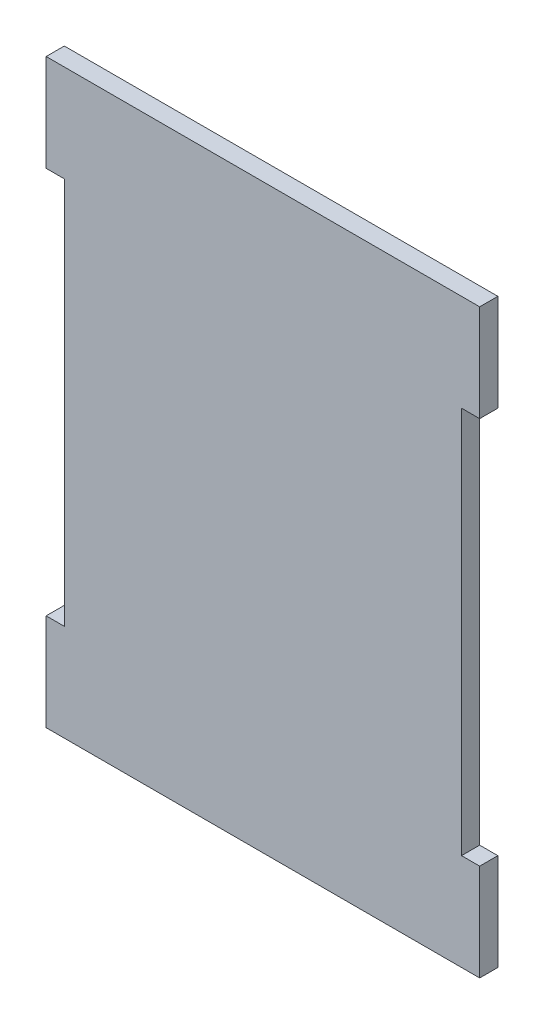
ISO-10303-21;
HEADER;
FILE_DESCRIPTION(('STEP AP214'),'2;1');
FILE_NAME('part.step','',(''),(''),'','','');
FILE_SCHEMA(('AUTOMOTIVE_DESIGN { 1 0 10303 214 1 1 1 1 }'));
ENDSEC;
DATA;
#1=APPLICATION_CONTEXT('core data for automotive mechanical design processes');
#2=APPLICATION_PROTOCOL_DEFINITION('international standard','automotive_design',2000,#1);
#3=PRODUCT_CONTEXT('',#1,'mechanical');
#4=PRODUCT('Part','Part','',(#3));
#5=PRODUCT_RELATED_PRODUCT_CATEGORY('part','',(#4));
#6=PRODUCT_DEFINITION_FORMATION('','',#4);
#7=PRODUCT_DEFINITION_CONTEXT('part definition',#1,'design');
#8=PRODUCT_DEFINITION('design','',#6,#7);
#9=PRODUCT_DEFINITION_SHAPE('','',#8);
#10=(LENGTH_UNIT() NAMED_UNIT(*) SI_UNIT(.MILLI.,.METRE.));
#11=(NAMED_UNIT(*) PLANE_ANGLE_UNIT() SI_UNIT($,.RADIAN.));
#12=(NAMED_UNIT(*) SI_UNIT($,.STERADIAN.) SOLID_ANGLE_UNIT());
#13=UNCERTAINTY_MEASURE_WITH_UNIT(LENGTH_MEASURE(1.E-05),#10,'distance_accuracy_value','');
#14=(GEOMETRIC_REPRESENTATION_CONTEXT(3) GLOBAL_UNCERTAINTY_ASSIGNED_CONTEXT((#13)) GLOBAL_UNIT_ASSIGNED_CONTEXT((#10,
#11,#12)) REPRESENTATION_CONTEXT('',''));
#15=CARTESIAN_POINT('',(0.,0.,0.));
#16=DIRECTION('',(0.,0.,1.));
#17=DIRECTION('',(1.,0.,0.));
#18=AXIS2_PLACEMENT_3D('',#15,#16,#17);
#19=CARTESIAN_POINT('',(0.,108.395374669268,4.7625));
#20=DIRECTION('',(1.,0.,0.));
#21=DIRECTION('',(0.,1.,0.));
#22=AXIS2_PLACEMENT_3D('',#19,#20,#21);
#23=PLANE('',#22);
#24=DIRECTION('',(0.,-1.,0.));
#25=VECTOR('',#24,1.);
#26=CARTESIAN_POINT('',(0.,108.395374669268,0.));
#27=LINE('',#26,#25);
#28=CARTESIAN_POINT('',(0.,108.395374669268,0.));
#29=VERTEX_POINT('',#28);
#30=CARTESIAN_POINT('',(0.,82.9953746692675,0.));
#31=VERTEX_POINT('',#30);
#32=EDGE_CURVE('E158',#29,#31,#27,.T.);
#33=ORIENTED_EDGE('',*,*,#32,.T.);
#34=DIRECTION('',(0.,0.,-1.));
#35=VECTOR('',#34,1.);
#36=CARTESIAN_POINT('',(0.,82.9953746692675,4.7625));
#37=LINE('',#36,#35);
#38=CARTESIAN_POINT('',(0.,82.9953746692675,4.7625));
#39=VERTEX_POINT('',#38);
#40=EDGE_CURVE('E41',#39,#31,#37,.T.);
#41=ORIENTED_EDGE('',*,*,#40,.F.);
#42=DIRECTION('',(0.,-1.,0.));
#43=VECTOR('',#42,1.);
#44=CARTESIAN_POINT('',(0.,108.395374669268,4.7625));
#45=LINE('',#44,#43);
#46=CARTESIAN_POINT('',(0.,108.395374669268,4.7625));
#47=VERTEX_POINT('',#46);
#48=EDGE_CURVE('E106',#47,#39,#45,.T.);
#49=ORIENTED_EDGE('',*,*,#48,.F.);
#50=DIRECTION('',(0.,0.,-1.));
#51=VECTOR('',#50,1.);
#52=CARTESIAN_POINT('',(0.,108.395374669268,4.7625));
#53=LINE('',#52,#51);
#54=EDGE_CURVE('E11',#47,#29,#53,.T.);
#55=ORIENTED_EDGE('',*,*,#54,.T.);
#56=EDGE_LOOP('',(#33,#41,#49,#55));
#57=FACE_BOUND('',#56,.T.);
#58=ADVANCED_FACE('F33',(#57),#23,.F.);
#59=CARTESIAN_POINT('',(4.7625,82.9953746692675,4.7625));
#60=DIRECTION('',(0.,1.,0.));
#61=DIRECTION('',(0.,0.,1.));
#62=AXIS2_PLACEMENT_3D('',#59,#60,#61);
#63=PLANE('',#62);
#64=DIRECTION('',(1.,0.,0.));
#65=VECTOR('',#64,1.);
#66=CARTESIAN_POINT('',(4.7625,82.9953746692675,0.));
#67=LINE('',#66,#65);
#68=CARTESIAN_POINT('',(4.7625,82.9953746692675,0.));
#69=VERTEX_POINT('',#68);
#70=EDGE_CURVE('E160',#31,#69,#67,.T.);
#71=ORIENTED_EDGE('',*,*,#70,.T.);
#72=DIRECTION('',(0.,0.,-1.));
#73=VECTOR('',#72,1.);
#74=CARTESIAN_POINT('',(4.7625,82.9953746692675,4.7625));
#75=LINE('',#74,#73);
#76=CARTESIAN_POINT('',(4.7625,82.9953746692675,4.7625));
#77=VERTEX_POINT('',#76);
#78=EDGE_CURVE('E198',#77,#69,#75,.T.);
#79=ORIENTED_EDGE('',*,*,#78,.F.);
#80=DIRECTION('',(1.,0.,0.));
#81=VECTOR('',#80,1.);
#82=CARTESIAN_POINT('',(4.7625,82.9953746692675,4.7625));
#83=LINE('',#82,#81);
#84=EDGE_CURVE('E206',#39,#77,#83,.T.);
#85=ORIENTED_EDGE('',*,*,#84,.F.);
#86=ORIENTED_EDGE('',*,*,#40,.T.);
#87=EDGE_LOOP('',(#71,#79,#85,#86));
#88=FACE_BOUND('',#87,.T.);
#89=ADVANCED_FACE('F204',(#88),#63,.F.);
#90=CARTESIAN_POINT('',(4.7625,82.9953746692675,4.7625));
#91=DIRECTION('',(1.,0.,0.));
#92=DIRECTION('',(0.,0.,-1.));
#93=AXIS2_PLACEMENT_3D('',#90,#91,#92);
#94=PLANE('',#93);
#95=DIRECTION('',(0.,-1.,0.));
#96=VECTOR('',#95,1.);
#97=CARTESIAN_POINT('',(4.7625,82.9953746692675,0.));
#98=LINE('',#97,#96);
#99=CARTESIAN_POINT('',(4.7625,-18.6046253307324,0.));
#100=VERTEX_POINT('',#99);
#101=EDGE_CURVE('E162',#69,#100,#98,.T.);
#102=ORIENTED_EDGE('',*,*,#101,.T.);
#103=DIRECTION('',(0.,0.,-1.));
#104=VECTOR('',#103,1.);
#105=CARTESIAN_POINT('',(4.7625,-18.6046253307324,4.7625));
#106=LINE('',#105,#104);
#107=CARTESIAN_POINT('',(4.7625,-18.6046253307324,4.7625));
#108=VERTEX_POINT('',#107);
#109=EDGE_CURVE('E195',#108,#100,#106,.T.);
#110=ORIENTED_EDGE('',*,*,#109,.F.);
#111=DIRECTION('',(0.,-1.,0.));
#112=VECTOR('',#111,1.);
#113=CARTESIAN_POINT('',(4.7625,82.9953746692675,4.7625));
#114=LINE('',#113,#112);
#115=EDGE_CURVE('E222',#77,#108,#114,.T.);
#116=ORIENTED_EDGE('',*,*,#115,.F.);
#117=ORIENTED_EDGE('',*,*,#78,.T.);
#118=EDGE_LOOP('',(#102,#110,#116,#117));
#119=FACE_BOUND('',#118,.T.);
#120=ADVANCED_FACE('F213',(#119),#94,.F.);
#121=CARTESIAN_POINT('',(4.7625,-18.6046253307324,4.7625));
#122=DIRECTION('',(0.,-1.,0.));
#123=DIRECTION('',(0.,0.,-1.));
#124=AXIS2_PLACEMENT_3D('',#121,#122,#123);
#125=PLANE('',#124);
#126=DIRECTION('',(-1.,0.,0.));
#127=VECTOR('',#126,1.);
#128=CARTESIAN_POINT('',(4.7625,-18.6046253307324,0.));
#129=LINE('',#128,#127);
#130=CARTESIAN_POINT('',(0.,-18.6046253307324,0.));
#131=VERTEX_POINT('',#130);
#132=EDGE_CURVE('E164',#100,#131,#129,.T.);
#133=ORIENTED_EDGE('',*,*,#132,.T.);
#134=DIRECTION('',(0.,0.,-1.));
#135=VECTOR('',#134,1.);
#136=CARTESIAN_POINT('',(0.,-18.6046253307324,4.7625));
#137=LINE('',#136,#135);
#138=CARTESIAN_POINT('',(0.,-18.6046253307324,4.7625));
#139=VERTEX_POINT('',#138);
#140=EDGE_CURVE('E192',#139,#131,#137,.T.);
#141=ORIENTED_EDGE('',*,*,#140,.F.);
#142=DIRECTION('',(-1.,0.,0.));
#143=VECTOR('',#142,1.);
#144=CARTESIAN_POINT('',(4.7625,-18.6046253307324,4.7625));
#145=LINE('',#144,#143);
#146=EDGE_CURVE('E219',#108,#139,#145,.T.);
#147=ORIENTED_EDGE('',*,*,#146,.F.);
#148=ORIENTED_EDGE('',*,*,#109,.T.);
#149=EDGE_LOOP('',(#133,#141,#147,#148));
#150=FACE_BOUND('',#149,.T.);
#151=ADVANCED_FACE('F217',(#150),#125,.F.);
#152=CARTESIAN_POINT('',(0.,-44.0046253307324,4.7625));
#153=DIRECTION('',(1.,0.,0.));
#154=DIRECTION('',(0.,1.,0.));
#155=AXIS2_PLACEMENT_3D('',#152,#153,#154);
#156=PLANE('',#155);
#157=DIRECTION('',(0.,-1.,0.));
#158=VECTOR('',#157,1.);
#159=CARTESIAN_POINT('',(0.,-44.0046253307324,0.));
#160=LINE('',#159,#158);
#161=CARTESIAN_POINT('',(0.,-44.0046253307324,0.));
#162=VERTEX_POINT('',#161);
#163=EDGE_CURVE('E166',#131,#162,#160,.T.);
#164=ORIENTED_EDGE('',*,*,#163,.T.);
#165=DIRECTION('',(0.,0.,-1.));
#166=VECTOR('',#165,1.);
#167=CARTESIAN_POINT('',(0.,-44.0046253307324,4.7625));
#168=LINE('',#167,#166);
#169=CARTESIAN_POINT('',(0.,-44.0046253307324,4.7625));
#170=VERTEX_POINT('',#169);
#171=EDGE_CURVE('E189',#170,#162,#168,.T.);
#172=ORIENTED_EDGE('',*,*,#171,.F.);
#173=DIRECTION('',(0.,-1.,0.));
#174=VECTOR('',#173,1.);
#175=CARTESIAN_POINT('',(0.,-44.0046253307324,4.7625));
#176=LINE('',#175,#174);
#177=EDGE_CURVE('E221',#139,#170,#176,.T.);
#178=ORIENTED_EDGE('',*,*,#177,.F.);
#179=ORIENTED_EDGE('',*,*,#140,.T.);
#180=EDGE_LOOP('',(#164,#172,#178,#179));
#181=FACE_BOUND('',#180,.T.);
#182=ADVANCED_FACE('F256',(#181),#156,.F.);
#183=CARTESIAN_POINT('',(108.9025,-44.0046253307325,4.7625));
#184=DIRECTION('',(0.,1.,0.));
#185=DIRECTION('',(-1.,0.,0.));
#186=AXIS2_PLACEMENT_3D('',#183,#184,#185);
#187=PLANE('',#186);
#188=DIRECTION('',(1.,0.,0.));
#189=VECTOR('',#188,1.);
#190=CARTESIAN_POINT('',(108.9025,-44.0046253307325,0.));
#191=LINE('',#190,#189);
#192=CARTESIAN_POINT('',(113.665,-44.0046253307323,0.));
#193=VERTEX_POINT('',#192);
#194=EDGE_CURVE('E169',#162,#193,#191,.T.);
#195=ORIENTED_EDGE('',*,*,#194,.T.);
#196=DIRECTION('',(0.,0.,-1.));
#197=VECTOR('',#196,1.);
#198=CARTESIAN_POINT('',(113.665,-44.0046253307323,4.7625));
#199=LINE('',#198,#197);
#200=CARTESIAN_POINT('',(113.665,-44.0046253307323,4.7625));
#201=VERTEX_POINT('',#200);
#202=EDGE_CURVE('E186',#201,#193,#199,.T.);
#203=ORIENTED_EDGE('',*,*,#202,.F.);
#204=DIRECTION('',(1.,0.,0.));
#205=VECTOR('',#204,1.);
#206=CARTESIAN_POINT('',(4.76250000000002,-44.0046253307325,4.7625));
#207=LINE('',#206,#205);
#208=EDGE_CURVE('E224',#170,#201,#207,.T.);
#209=ORIENTED_EDGE('',*,*,#208,.F.);
#210=ORIENTED_EDGE('',*,*,#171,.T.);
#211=EDGE_LOOP('',(#195,#203,#209,#210));
#212=FACE_BOUND('',#211,.T.);
#213=ADVANCED_FACE('F259',(#212),#187,.F.);
#214=CARTESIAN_POINT('',(113.665,-44.0046253307323,4.7625));
#215=DIRECTION('',(-1.,0.,0.));
#216=DIRECTION('',(0.,0.,1.));
#217=AXIS2_PLACEMENT_3D('',#214,#215,#216);
#218=PLANE('',#217);
#219=DIRECTION('',(0.,1.,0.));
#220=VECTOR('',#219,1.);
#221=CARTESIAN_POINT('',(113.665,-44.0046253307323,0.));
#222=LINE('',#221,#220);
#223=CARTESIAN_POINT('',(113.665,-18.6046253307323,0.));
#224=VERTEX_POINT('',#223);
#225=EDGE_CURVE('E171',#193,#224,#222,.T.);
#226=ORIENTED_EDGE('',*,*,#225,.T.);
#227=DIRECTION('',(0.,0.,-1.));
#228=VECTOR('',#227,1.);
#229=CARTESIAN_POINT('',(113.665,-18.6046253307323,4.7625));
#230=LINE('',#229,#228);
#231=CARTESIAN_POINT('',(113.665,-18.6046253307323,4.7625));
#232=VERTEX_POINT('',#231);
#233=EDGE_CURVE('E183',#232,#224,#230,.T.);
#234=ORIENTED_EDGE('',*,*,#233,.F.);
#235=DIRECTION('',(0.,1.,0.));
#236=VECTOR('',#235,1.);
#237=CARTESIAN_POINT('',(113.665,-44.0046253307323,4.7625));
#238=LINE('',#237,#236);
#239=EDGE_CURVE('E230',#201,#232,#238,.T.);
#240=ORIENTED_EDGE('',*,*,#239,.F.);
#241=ORIENTED_EDGE('',*,*,#202,.T.);
#242=EDGE_LOOP('',(#226,#234,#240,#241));
#243=FACE_BOUND('',#242,.T.);
#244=ADVANCED_FACE('F236',(#243),#218,.F.);
#245=CARTESIAN_POINT('',(108.9025,-18.6046253307323,4.7625));
#246=DIRECTION('',(0.,-1.,0.));
#247=DIRECTION('',(0.,0.,-1.));
#248=AXIS2_PLACEMENT_3D('',#245,#246,#247);
#249=PLANE('',#248);
#250=DIRECTION('',(-1.,0.,0.));
#251=VECTOR('',#250,1.);
#252=CARTESIAN_POINT('',(108.9025,-18.6046253307323,0.));
#253=LINE('',#252,#251);
#254=CARTESIAN_POINT('',(108.9025,-18.6046253307323,0.));
#255=VERTEX_POINT('',#254);
#256=EDGE_CURVE('E173',#224,#255,#253,.T.);
#257=ORIENTED_EDGE('',*,*,#256,.T.);
#258=DIRECTION('',(0.,0.,-1.));
#259=VECTOR('',#258,1.);
#260=CARTESIAN_POINT('',(108.9025,-18.6046253307323,4.7625));
#261=LINE('',#260,#259);
#262=CARTESIAN_POINT('',(108.9025,-18.6046253307323,4.7625));
#263=VERTEX_POINT('',#262);
#264=EDGE_CURVE('E147',#263,#255,#261,.T.);
#265=ORIENTED_EDGE('',*,*,#264,.F.);
#266=DIRECTION('',(-1.,0.,0.));
#267=VECTOR('',#266,1.);
#268=CARTESIAN_POINT('',(108.9025,-18.6046253307323,4.7625));
#269=LINE('',#268,#267);
#270=EDGE_CURVE('E138',#232,#263,#269,.T.);
#271=ORIENTED_EDGE('',*,*,#270,.F.);
#272=ORIENTED_EDGE('',*,*,#233,.T.);
#273=EDGE_LOOP('',(#257,#265,#271,#272));
#274=FACE_BOUND('',#273,.T.);
#275=ADVANCED_FACE('F240',(#274),#249,.F.);
#276=CARTESIAN_POINT('',(108.9025,82.9953746692676,4.7625));
#277=DIRECTION('',(-1.,0.,0.));
#278=DIRECTION('',(0.,-1.,0.));
#279=AXIS2_PLACEMENT_3D('',#276,#277,#278);
#280=PLANE('',#279);
#281=DIRECTION('',(0.,1.,0.));
#282=VECTOR('',#281,1.);
#283=CARTESIAN_POINT('',(108.9025,82.9953746692676,0.));
#284=LINE('',#283,#282);
#285=CARTESIAN_POINT('',(108.9025,82.9953746692676,0.));
#286=VERTEX_POINT('',#285);
#287=EDGE_CURVE('E146',#255,#286,#284,.T.);
#288=ORIENTED_EDGE('',*,*,#287,.T.);
#289=DIRECTION('',(0.,0.,-1.));
#290=VECTOR('',#289,1.);
#291=CARTESIAN_POINT('',(108.9025,82.9953746692676,4.7625));
#292=LINE('',#291,#290);
#293=CARTESIAN_POINT('',(108.9025,82.9953746692676,4.7625));
#294=VERTEX_POINT('',#293);
#295=EDGE_CURVE('E143',#294,#286,#292,.T.);
#296=ORIENTED_EDGE('',*,*,#295,.F.);
#297=DIRECTION('',(0.,1.,0.));
#298=VECTOR('',#297,1.);
#299=CARTESIAN_POINT('',(108.9025,82.9953746692676,4.7625));
#300=LINE('',#299,#298);
#301=EDGE_CURVE('E132',#263,#294,#300,.T.);
#302=ORIENTED_EDGE('',*,*,#301,.F.);
#303=ORIENTED_EDGE('',*,*,#264,.T.);
#304=EDGE_LOOP('',(#288,#296,#302,#303));
#305=FACE_BOUND('',#304,.T.);
#306=ADVANCED_FACE('F144',(#305),#280,.F.);
#307=CARTESIAN_POINT('',(108.9025,82.9953746692676,4.7625));
#308=DIRECTION('',(0.,1.,0.));
#309=DIRECTION('',(0.,0.,1.));
#310=AXIS2_PLACEMENT_3D('',#307,#308,#309);
#311=PLANE('',#310);
#312=DIRECTION('',(1.,0.,0.));
#313=VECTOR('',#312,1.);
#314=CARTESIAN_POINT('',(108.9025,82.9953746692676,0.));
#315=LINE('',#314,#313);
#316=CARTESIAN_POINT('',(113.665,82.9953746692676,0.));
#317=VERTEX_POINT('',#316);
#318=EDGE_CURVE('E91',#286,#317,#315,.T.);
#319=ORIENTED_EDGE('',*,*,#318,.T.);
#320=DIRECTION('',(0.,0.,-1.));
#321=VECTOR('',#320,1.);
#322=CARTESIAN_POINT('',(113.665,82.9953746692676,4.7625));
#323=LINE('',#322,#321);
#324=CARTESIAN_POINT('',(113.665,82.9953746692676,4.7625));
#325=VERTEX_POINT('',#324);
#326=EDGE_CURVE('E148',#325,#317,#323,.T.);
#327=ORIENTED_EDGE('',*,*,#326,.F.);
#328=DIRECTION('',(1.,0.,0.));
#329=VECTOR('',#328,1.);
#330=CARTESIAN_POINT('',(108.9025,82.9953746692676,4.7625));
#331=LINE('',#330,#329);
#332=EDGE_CURVE('E136',#294,#325,#331,.T.);
#333=ORIENTED_EDGE('',*,*,#332,.F.);
#334=ORIENTED_EDGE('',*,*,#295,.T.);
#335=EDGE_LOOP('',(#319,#327,#333,#334));
#336=FACE_BOUND('',#335,.T.);
#337=ADVANCED_FACE('F150',(#336),#311,.F.);
#338=CARTESIAN_POINT('',(113.665,108.395374669268,4.7625));
#339=DIRECTION('',(-1.,0.,0.));
#340=DIRECTION('',(0.,0.,1.));
#341=AXIS2_PLACEMENT_3D('',#338,#339,#340);
#342=PLANE('',#341);
#343=DIRECTION('',(0.,1.,0.));
#344=VECTOR('',#343,1.);
#345=CARTESIAN_POINT('',(113.665,108.395374669268,0.));
#346=LINE('',#345,#344);
#347=CARTESIAN_POINT('',(113.665,108.395374669268,0.));
#348=VERTEX_POINT('',#347);
#349=EDGE_CURVE('E177',#317,#348,#346,.T.);
#350=ORIENTED_EDGE('',*,*,#349,.T.);
#351=DIRECTION('',(0.,0.,-1.));
#352=VECTOR('',#351,1.);
#353=CARTESIAN_POINT('',(113.665,108.395374669268,4.7625));
#354=LINE('',#353,#352);
#355=CARTESIAN_POINT('',(113.665,108.395374669268,4.7625));
#356=VERTEX_POINT('',#355);
#357=EDGE_CURVE('E154',#356,#348,#354,.T.);
#358=ORIENTED_EDGE('',*,*,#357,.F.);
#359=DIRECTION('',(0.,1.,0.));
#360=VECTOR('',#359,1.);
#361=CARTESIAN_POINT('',(113.665,108.395374669268,4.7625));
#362=LINE('',#361,#360);
#363=EDGE_CURVE('E152',#325,#356,#362,.T.);
#364=ORIENTED_EDGE('',*,*,#363,.F.);
#365=ORIENTED_EDGE('',*,*,#326,.T.);
#366=EDGE_LOOP('',(#350,#358,#364,#365));
#367=FACE_BOUND('',#366,.T.);
#368=ADVANCED_FACE('F243',(#367),#342,.F.);
#369=CARTESIAN_POINT('',(4.7625,108.395374669268,4.7625));
#370=DIRECTION('',(0.,-1.,0.));
#371=DIRECTION('',(0.,0.,-1.));
#372=AXIS2_PLACEMENT_3D('',#369,#370,#371);
#373=PLANE('',#372);
#374=DIRECTION('',(-1.,0.,0.));
#375=VECTOR('',#374,1.);
#376=CARTESIAN_POINT('',(4.7625,108.395374669268,0.));
#377=LINE('',#376,#375);
#378=EDGE_CURVE('E98',#348,#29,#377,.T.);
#379=ORIENTED_EDGE('',*,*,#378,.T.);
#380=ORIENTED_EDGE('',*,*,#54,.F.);
#381=DIRECTION('',(-1.,0.,0.));
#382=VECTOR('',#381,1.);
#383=CARTESIAN_POINT('',(4.7625,108.395374669268,4.7625));
#384=LINE('',#383,#382);
#385=EDGE_CURVE('E49',#356,#47,#384,.T.);
#386=ORIENTED_EDGE('',*,*,#385,.F.);
#387=ORIENTED_EDGE('',*,*,#357,.T.);
#388=EDGE_LOOP('',(#379,#380,#386,#387));
#389=FACE_BOUND('',#388,.T.);
#390=ADVANCED_FACE('F244',(#389),#373,.F.);
#391=CARTESIAN_POINT('',(0.,0.,4.7625));
#392=DIRECTION('',(0.,0.,1.));
#393=DIRECTION('',(1.,0.,0.));
#394=AXIS2_PLACEMENT_3D('',#391,#392,#393);
#395=PLANE('',#394);
#396=ORIENTED_EDGE('',*,*,#385,.T.);
#397=ORIENTED_EDGE('',*,*,#48,.T.);
#398=ORIENTED_EDGE('',*,*,#84,.T.);
#399=ORIENTED_EDGE('',*,*,#115,.T.);
#400=ORIENTED_EDGE('',*,*,#146,.T.);
#401=ORIENTED_EDGE('',*,*,#177,.T.);
#402=ORIENTED_EDGE('',*,*,#208,.T.);
#403=ORIENTED_EDGE('',*,*,#239,.T.);
#404=ORIENTED_EDGE('',*,*,#270,.T.);
#405=ORIENTED_EDGE('',*,*,#301,.T.);
#406=ORIENTED_EDGE('',*,*,#332,.T.);
#407=ORIENTED_EDGE('',*,*,#363,.T.);
#408=EDGE_LOOP('',(#396,#397,#398,#399,#400,#401,#402,#403,#404,#405,#406,#407));
#409=FACE_BOUND('',#408,.T.);
#410=ADVANCED_FACE('F134',(#409),#395,.T.);
#411=CARTESIAN_POINT('',(0.,0.,0.));
#412=DIRECTION('',(0.,0.,1.));
#413=DIRECTION('',(1.,0.,0.));
#414=AXIS2_PLACEMENT_3D('',#411,#412,#413);
#415=PLANE('',#414);
#416=ORIENTED_EDGE('',*,*,#32,.F.);
#417=ORIENTED_EDGE('',*,*,#378,.F.);
#418=ORIENTED_EDGE('',*,*,#349,.F.);
#419=ORIENTED_EDGE('',*,*,#318,.F.);
#420=ORIENTED_EDGE('',*,*,#287,.F.);
#421=ORIENTED_EDGE('',*,*,#256,.F.);
#422=ORIENTED_EDGE('',*,*,#225,.F.);
#423=ORIENTED_EDGE('',*,*,#194,.F.);
#424=ORIENTED_EDGE('',*,*,#163,.F.);
#425=ORIENTED_EDGE('',*,*,#132,.F.);
#426=ORIENTED_EDGE('',*,*,#101,.F.);
#427=ORIENTED_EDGE('',*,*,#70,.F.);
#428=EDGE_LOOP('',(#416,#417,#418,#419,#420,#421,#422,#423,#424,#425,#426,#427));
#429=FACE_BOUND('',#428,.T.);
#430=ADVANCED_FACE('F208',(#429),#415,.F.);
#431=CLOSED_SHELL('',(#58,#89,#120,#151,#182,#213,#244,#275,#306,#337,#368,#390,#410,#430));
#432=MANIFOLD_SOLID_BREP('B2',#431);
#433=ADVANCED_BREP_SHAPE_REPRESENTATION('',(#18,#432),#14);
#434=SHAPE_DEFINITION_REPRESENTATION(#9,#433);
ENDSEC;
END-ISO-10303-21;
